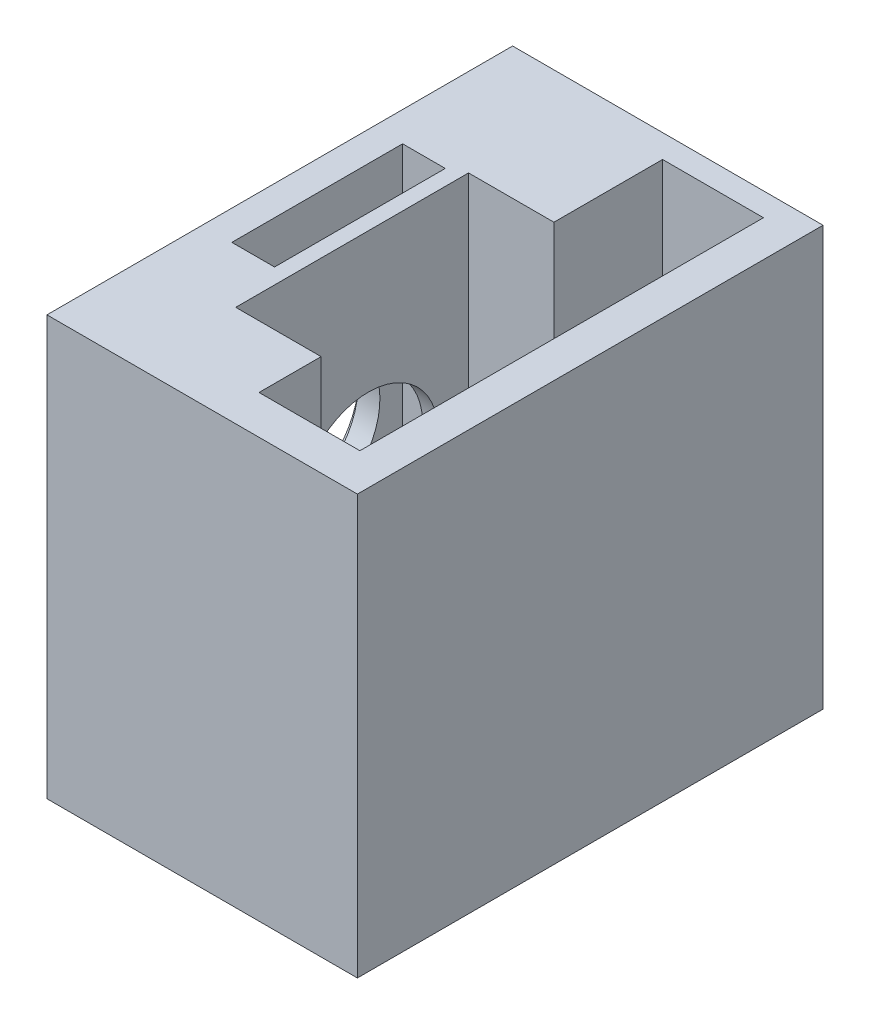
ISO-10303-21;
HEADER;
FILE_DESCRIPTION(('STEP AP214'),'2;1');
FILE_NAME('part.step','',(''),(''),'','','');
FILE_SCHEMA(('AUTOMOTIVE_DESIGN { 1 0 10303 214 1 1 1 1 }'));
ENDSEC;
DATA;
#1=APPLICATION_CONTEXT('core data for automotive mechanical design processes');
#2=APPLICATION_PROTOCOL_DEFINITION('international standard','automotive_design',2000,#1);
#3=PRODUCT_CONTEXT('',#1,'mechanical');
#4=PRODUCT('Part','Part','',(#3));
#5=PRODUCT_RELATED_PRODUCT_CATEGORY('part','',(#4));
#6=PRODUCT_DEFINITION_FORMATION('','',#4);
#7=PRODUCT_DEFINITION_CONTEXT('part definition',#1,'design');
#8=PRODUCT_DEFINITION('design','',#6,#7);
#9=PRODUCT_DEFINITION_SHAPE('','',#8);
#10=(LENGTH_UNIT() NAMED_UNIT(*) SI_UNIT(.MILLI.,.METRE.));
#11=(NAMED_UNIT(*) PLANE_ANGLE_UNIT() SI_UNIT($,.RADIAN.));
#12=(NAMED_UNIT(*) SI_UNIT($,.STERADIAN.) SOLID_ANGLE_UNIT());
#13=UNCERTAINTY_MEASURE_WITH_UNIT(LENGTH_MEASURE(1.E-05),#10,'distance_accuracy_value','');
#14=(GEOMETRIC_REPRESENTATION_CONTEXT(3) GLOBAL_UNCERTAINTY_ASSIGNED_CONTEXT((#13)) GLOBAL_UNIT_ASSIGNED_CONTEXT((#10,
#11,#12)) REPRESENTATION_CONTEXT('',''));
#15=CARTESIAN_POINT('',(0.,0.,0.));
#16=DIRECTION('',(0.,0.,1.));
#17=DIRECTION('',(1.,0.,0.));
#18=AXIS2_PLACEMENT_3D('',#15,#16,#17);
#19=CARTESIAN_POINT('',(0.,9.5,0.));
#20=DIRECTION('',(0.,1.,0.));
#21=DIRECTION('',(0.,0.,1.));
#22=AXIS2_PLACEMENT_3D('',#19,#20,#21);
#23=PLANE('',#22);
#24=DIRECTION('',(-1.,0.,0.));
#25=VECTOR('',#24,1.);
#26=CARTESIAN_POINT('',(6.5,9.5,-17.1015528128088));
#27=LINE('',#26,#25);
#28=CARTESIAN_POINT('',(4.66196126146727,9.5,-17.1015528128088));
#29=VERTEX_POINT('',#28);
#30=CARTESIAN_POINT('',(1.91196126146727,9.5,-17.1015528128088));
#31=VERTEX_POINT('',#30);
#32=EDGE_CURVE('E11',#29,#31,#27,.T.);
#33=ORIENTED_EDGE('',*,*,#32,.F.);
#34=DIRECTION('',(0.,0.,-1.));
#35=VECTOR('',#34,1.);
#36=CARTESIAN_POINT('',(4.66196126146727,9.5,-21.));
#37=LINE('',#36,#35);
#38=CARTESIAN_POINT('',(4.66196126146727,9.5,-21.));
#39=VERTEX_POINT('',#38);
#40=EDGE_CURVE('E173',#29,#39,#37,.T.);
#41=ORIENTED_EDGE('',*,*,#40,.T.);
#42=DIRECTION('',(-1.,0.,0.));
#43=VECTOR('',#42,1.);
#44=CARTESIAN_POINT('',(1.91196126146727,9.5,-21.));
#45=LINE('',#44,#43);
#46=CARTESIAN_POINT('',(1.91196126146727,9.5,-21.));
#47=VERTEX_POINT('',#46);
#48=EDGE_CURVE('E179',#39,#47,#45,.T.);
#49=ORIENTED_EDGE('',*,*,#48,.T.);
#50=DIRECTION('',(0.,0.,1.));
#51=VECTOR('',#50,1.);
#52=CARTESIAN_POINT('',(1.91196126146727,9.5,-21.));
#53=LINE('',#52,#51);
#54=EDGE_CURVE('E588',#47,#31,#53,.T.);
#55=ORIENTED_EDGE('',*,*,#54,.T.);
#56=EDGE_LOOP('',(#33,#41,#49,#55));
#57=FACE_BOUND('',#56,.T.);
#58=ADVANCED_FACE('F35',(#57),#23,.T.);
#59=CARTESIAN_POINT('',(20.,27.,0.));
#60=DIRECTION('',(0.,-1.,0.));
#61=DIRECTION('',(0.,0.,-1.));
#62=AXIS2_PLACEMENT_3D('',#59,#60,#61);
#63=PLANE('',#62);
#64=DIRECTION('',(1.,0.,0.));
#65=VECTOR('',#64,1.);
#66=CARTESIAN_POINT('',(1.91196126146727,27.,-9.99999999999999));
#67=LINE('',#66,#65);
#68=CARTESIAN_POINT('',(1.91196126146728,27.,-9.99999999999999));
#69=VERTEX_POINT('',#68);
#70=CARTESIAN_POINT('',(4.66196126146727,27.,-9.99999999999999));
#71=VERTEX_POINT('',#70);
#72=EDGE_CURVE('E188',#69,#71,#67,.T.);
#73=ORIENTED_EDGE('',*,*,#72,.F.);
#74=DIRECTION('',(0.,0.,1.));
#75=VECTOR('',#74,1.);
#76=CARTESIAN_POINT('',(1.91196126146727,27.,-21.));
#77=LINE('',#76,#75);
#78=CARTESIAN_POINT('',(1.91196126146727,27.,-21.));
#79=VERTEX_POINT('',#78);
#80=EDGE_CURVE('E57',#79,#69,#77,.T.);
#81=ORIENTED_EDGE('',*,*,#80,.F.);
#82=DIRECTION('',(-1.,0.,0.));
#83=VECTOR('',#82,1.);
#84=CARTESIAN_POINT('',(1.91196126146727,27.,-21.));
#85=LINE('',#84,#83);
#86=CARTESIAN_POINT('',(4.66196126146727,27.,-21.));
#87=VERTEX_POINT('',#86);
#88=EDGE_CURVE('E195',#87,#79,#85,.T.);
#89=ORIENTED_EDGE('',*,*,#88,.F.);
#90=DIRECTION('',(0.,0.,-1.));
#91=VECTOR('',#90,1.);
#92=CARTESIAN_POINT('',(4.66196126146727,27.,-21.));
#93=LINE('',#92,#91);
#94=EDGE_CURVE('E192',#71,#87,#93,.T.);
#95=ORIENTED_EDGE('',*,*,#94,.F.);
#96=EDGE_LOOP('',(#73,#81,#89,#95));
#97=FACE_BOUND('',#96,.T.);
#98=DIRECTION('',(0.,0.,1.));
#99=VECTOR('',#98,1.);
#100=CARTESIAN_POINT('',(0.,27.,0.));
#101=LINE('',#100,#99);
#102=CARTESIAN_POINT('',(0.,27.,-30.));
#103=VERTEX_POINT('',#102);
#104=CARTESIAN_POINT('',(0.,27.,0.));
#105=VERTEX_POINT('',#104);
#106=EDGE_CURVE('E279',#103,#105,#101,.T.);
#107=ORIENTED_EDGE('',*,*,#106,.T.);
#108=DIRECTION('',(-1.,0.,0.));
#109=VECTOR('',#108,1.);
#110=CARTESIAN_POINT('',(20.,27.,0.));
#111=LINE('',#110,#109);
#112=CARTESIAN_POINT('',(20.,27.,0.));
#113=VERTEX_POINT('',#112);
#114=EDGE_CURVE('E285',#113,#105,#111,.T.);
#115=ORIENTED_EDGE('',*,*,#114,.F.);
#116=DIRECTION('',(0.,0.,1.));
#117=VECTOR('',#116,1.);
#118=CARTESIAN_POINT('',(20.,27.,0.));
#119=LINE('',#118,#117);
#120=CARTESIAN_POINT('',(20.,27.,-30.));
#121=VERTEX_POINT('',#120);
#122=EDGE_CURVE('E283',#121,#113,#119,.T.);
#123=ORIENTED_EDGE('',*,*,#122,.F.);
#124=DIRECTION('',(-1.,0.,0.));
#125=VECTOR('',#124,1.);
#126=CARTESIAN_POINT('',(20.,27.,-30.));
#127=LINE('',#126,#125);
#128=EDGE_CURVE('E295',#121,#103,#127,.T.);
#129=ORIENTED_EDGE('',*,*,#128,.T.);
#130=EDGE_LOOP('',(#107,#115,#123,#129));
#131=FACE_BOUND('',#130,.T.);
#132=DIRECTION('',(0.,0.,1.));
#133=VECTOR('',#132,1.);
#134=CARTESIAN_POINT('',(5.66196126146727,27.,-21.5));
#135=LINE('',#134,#133);
#136=CARTESIAN_POINT('',(5.66196126146727,27.,-21.5));
#137=VERTEX_POINT('',#136);
#138=CARTESIAN_POINT('',(5.66196126146727,27.,-6.5));
#139=VERTEX_POINT('',#138);
#140=EDGE_CURVE('E210',#137,#139,#135,.T.);
#141=ORIENTED_EDGE('',*,*,#140,.F.);
#142=DIRECTION('',(-1.,0.,0.));
#143=VECTOR('',#142,1.);
#144=CARTESIAN_POINT('',(5.66196126146727,27.,-21.5));
#145=LINE('',#144,#143);
#146=CARTESIAN_POINT('',(11.1619612614673,27.,-21.5));
#147=VERTEX_POINT('',#146);
#148=EDGE_CURVE('E217',#147,#137,#145,.T.);
#149=ORIENTED_EDGE('',*,*,#148,.F.);
#150=DIRECTION('',(0.,0.,1.));
#151=VECTOR('',#150,1.);
#152=CARTESIAN_POINT('',(11.1619612614673,26.9999999999758,-28.5));
#153=LINE('',#152,#151);
#154=CARTESIAN_POINT('',(11.1619612614673,27.,-28.5));
#155=VERTEX_POINT('',#154);
#156=EDGE_CURVE('E244',#155,#147,#153,.T.);
#157=ORIENTED_EDGE('',*,*,#156,.F.);
#158=DIRECTION('',(1.,0.,0.));
#159=VECTOR('',#158,1.);
#160=CARTESIAN_POINT('',(11.1619612614673,26.9999999999758,-28.5));
#161=LINE('',#160,#159);
#162=CARTESIAN_POINT('',(17.6619612614673,26.9999999999758,-28.5));
#163=VERTEX_POINT('',#162);
#164=EDGE_CURVE('E233',#155,#163,#161,.T.);
#165=ORIENTED_EDGE('',*,*,#164,.T.);
#166=DIRECTION('',(0.,0.,1.));
#167=VECTOR('',#166,1.);
#168=CARTESIAN_POINT('',(17.6619612614673,26.9999999999758,-28.5));
#169=LINE('',#168,#167);
#170=CARTESIAN_POINT('',(17.6619612614673,26.9999999999758,-2.5));
#171=VERTEX_POINT('',#170);
#172=EDGE_CURVE('E255',#163,#171,#169,.T.);
#173=ORIENTED_EDGE('',*,*,#172,.T.);
#174=DIRECTION('',(1.,0.,0.));
#175=VECTOR('',#174,1.);
#176=CARTESIAN_POINT('',(11.1619612614673,26.9999999999758,-2.5));
#177=LINE('',#176,#175);
#178=CARTESIAN_POINT('',(11.1619612614673,26.9999999999758,-2.5));
#179=VERTEX_POINT('',#178);
#180=EDGE_CURVE('E258',#179,#171,#177,.T.);
#181=ORIENTED_EDGE('',*,*,#180,.F.);
#182=CARTESIAN_POINT('',(11.1619612614673,27.,-6.5));
#183=VERTEX_POINT('',#182);
#184=EDGE_CURVE('E261',#183,#179,#153,.T.);
#185=ORIENTED_EDGE('',*,*,#184,.F.);
#186=DIRECTION('',(1.,0.,0.));
#187=VECTOR('',#186,1.);
#188=CARTESIAN_POINT('',(5.66196126146727,27.,-6.5));
#189=LINE('',#188,#187);
#190=EDGE_CURVE('E227',#139,#183,#189,.T.);
#191=ORIENTED_EDGE('',*,*,#190,.F.);
#192=EDGE_LOOP('',(#141,#149,#157,#165,#173,#181,#185,#191));
#193=FACE_BOUND('',#192,.T.);
#194=ADVANCED_FACE('F320',(#97,#131,#193),#63,.F.);
#195=CARTESIAN_POINT('',(20.,0.,0.));
#196=DIRECTION('',(0.,0.,-1.));
#197=DIRECTION('',(0.,1.,0.));
#198=AXIS2_PLACEMENT_3D('',#195,#196,#197);
#199=PLANE('',#198);
#200=DIRECTION('',(0.,-1.,0.));
#201=VECTOR('',#200,1.);
#202=CARTESIAN_POINT('',(0.,0.,0.));
#203=LINE('',#202,#201);
#204=CARTESIAN_POINT('',(0.,0.,0.));
#205=VERTEX_POINT('',#204);
#206=EDGE_CURVE('E274',#105,#205,#203,.T.);
#207=ORIENTED_EDGE('',*,*,#206,.T.);
#208=DIRECTION('',(-1.,0.,0.));
#209=VECTOR('',#208,1.);
#210=CARTESIAN_POINT('',(20.,0.,0.));
#211=LINE('',#210,#209);
#212=CARTESIAN_POINT('',(20.,0.,0.));
#213=VERTEX_POINT('',#212);
#214=EDGE_CURVE('E165',#213,#205,#211,.T.);
#215=ORIENTED_EDGE('',*,*,#214,.F.);
#216=DIRECTION('',(0.,-1.,0.));
#217=VECTOR('',#216,1.);
#218=CARTESIAN_POINT('',(20.,0.,0.));
#219=LINE('',#218,#217);
#220=EDGE_CURVE('E275',#113,#213,#219,.T.);
#221=ORIENTED_EDGE('',*,*,#220,.F.);
#222=ORIENTED_EDGE('',*,*,#114,.T.);
#223=EDGE_LOOP('',(#207,#215,#221,#222));
#224=FACE_BOUND('',#223,.T.);
#225=ADVANCED_FACE('F37',(#224),#199,.F.);
#226=CARTESIAN_POINT('',(20.,0.,0.));
#227=DIRECTION('',(0.,1.,0.));
#228=DIRECTION('',(0.,0.,1.));
#229=AXIS2_PLACEMENT_3D('',#226,#227,#228);
#230=PLANE('',#229);
#231=DIRECTION('',(0.,0.,-1.));
#232=VECTOR('',#231,1.);
#233=CARTESIAN_POINT('',(0.,0.,0.));
#234=LINE('',#233,#232);
#235=CARTESIAN_POINT('',(0.,0.,-30.));
#236=VERTEX_POINT('',#235);
#237=EDGE_CURVE('E288',#205,#236,#234,.T.);
#238=ORIENTED_EDGE('',*,*,#237,.T.);
#239=DIRECTION('',(-1.,0.,0.));
#240=VECTOR('',#239,1.);
#241=CARTESIAN_POINT('',(20.,0.,-30.));
#242=LINE('',#241,#240);
#243=CARTESIAN_POINT('',(20.,0.,-30.));
#244=VERTEX_POINT('',#243);
#245=EDGE_CURVE('E298',#244,#236,#242,.T.);
#246=ORIENTED_EDGE('',*,*,#245,.F.);
#247=DIRECTION('',(0.,0.,-1.));
#248=VECTOR('',#247,1.);
#249=CARTESIAN_POINT('',(20.,0.,0.));
#250=LINE('',#249,#248);
#251=EDGE_CURVE('E278',#213,#244,#250,.T.);
#252=ORIENTED_EDGE('',*,*,#251,.F.);
#253=ORIENTED_EDGE('',*,*,#214,.T.);
#254=EDGE_LOOP('',(#238,#246,#252,#253));
#255=FACE_BOUND('',#254,.T.);
#256=ADVANCED_FACE('F304',(#255),#230,.F.);
#257=CARTESIAN_POINT('',(20.,0.,-30.));
#258=DIRECTION('',(0.,0.,1.));
#259=DIRECTION('',(1.,0.,0.));
#260=AXIS2_PLACEMENT_3D('',#257,#258,#259);
#261=PLANE('',#260);
#262=DIRECTION('',(0.,1.,0.));
#263=VECTOR('',#262,1.);
#264=CARTESIAN_POINT('',(0.,0.,-30.));
#265=LINE('',#264,#263);
#266=EDGE_CURVE('E290',#236,#103,#265,.T.);
#267=ORIENTED_EDGE('',*,*,#266,.T.);
#268=ORIENTED_EDGE('',*,*,#128,.F.);
#269=DIRECTION('',(0.,1.,0.));
#270=VECTOR('',#269,1.);
#271=CARTESIAN_POINT('',(20.,0.,-30.));
#272=LINE('',#271,#270);
#273=EDGE_CURVE('E281',#244,#121,#272,.T.);
#274=ORIENTED_EDGE('',*,*,#273,.F.);
#275=ORIENTED_EDGE('',*,*,#245,.T.);
#276=EDGE_LOOP('',(#267,#268,#274,#275));
#277=FACE_BOUND('',#276,.T.);
#278=ADVANCED_FACE('F316',(#277),#261,.F.);
#279=CARTESIAN_POINT('',(20.,0.,0.));
#280=DIRECTION('',(-1.,0.,0.));
#281=DIRECTION('',(0.,0.,1.));
#282=AXIS2_PLACEMENT_3D('',#279,#280,#281);
#283=PLANE('',#282);
#284=ORIENTED_EDGE('',*,*,#220,.T.);
#285=ORIENTED_EDGE('',*,*,#251,.T.);
#286=ORIENTED_EDGE('',*,*,#273,.T.);
#287=ORIENTED_EDGE('',*,*,#122,.T.);
#288=EDGE_LOOP('',(#284,#285,#286,#287));
#289=FACE_BOUND('',#288,.T.);
#290=ADVANCED_FACE('F323',(#289),#283,.F.);
#291=CARTESIAN_POINT('',(0.,0.,0.));
#292=DIRECTION('',(-1.,0.,0.));
#293=DIRECTION('',(0.,0.,1.));
#294=AXIS2_PLACEMENT_3D('',#291,#292,#293);
#295=PLANE('',#294);
#296=CARTESIAN_POINT('',(0.,13.5,-15.1));
#297=DIRECTION('',(-1.,0.,0.));
#298=DIRECTION('',(0.,0.,1.));
#299=AXIS2_PLACEMENT_3D('',#296,#297,#298);
#300=CIRCLE('',#299,5.);
#301=CARTESIAN_POINT('',(0.,13.5,-10.1));
#302=VERTEX_POINT('',#301);
#303=EDGE_CURVE('E201',#302,#302,#300,.T.);
#304=ORIENTED_EDGE('',*,*,#303,.F.);
#305=EDGE_LOOP('',(#304));
#306=FACE_BOUND('',#305,.T.);
#307=ORIENTED_EDGE('',*,*,#206,.F.);
#308=ORIENTED_EDGE('',*,*,#106,.F.);
#309=ORIENTED_EDGE('',*,*,#266,.F.);
#310=ORIENTED_EDGE('',*,*,#237,.F.);
#311=EDGE_LOOP('',(#307,#308,#309,#310));
#312=FACE_BOUND('',#311,.T.);
#313=ADVANCED_FACE('F312',(#306,#312),#295,.T.);
#314=CARTESIAN_POINT('',(11.1619612614673,0.999999999975808,-28.5));
#315=DIRECTION('',(0.,0.,1.));
#316=DIRECTION('',(1.,0.,0.));
#317=AXIS2_PLACEMENT_3D('',#314,#315,#316);
#318=PLANE('',#317);
#319=ORIENTED_EDGE('',*,*,#164,.F.);
#320=DIRECTION('',(0.,1.,0.));
#321=VECTOR('',#320,1.);
#322=CARTESIAN_POINT('',(11.1619612614673,0.999999999975808,-28.5));
#323=LINE('',#322,#321);
#324=CARTESIAN_POINT('',(11.1619612614673,0.999999999975808,-28.5));
#325=VERTEX_POINT('',#324);
#326=EDGE_CURVE('E252',#325,#155,#323,.T.);
#327=ORIENTED_EDGE('',*,*,#326,.F.);
#328=DIRECTION('',(1.,0.,0.));
#329=VECTOR('',#328,1.);
#330=CARTESIAN_POINT('',(11.1619612614673,0.999999999975808,-28.5));
#331=LINE('',#330,#329);
#332=CARTESIAN_POINT('',(17.6619612614673,0.999999999975808,-28.5));
#333=VERTEX_POINT('',#332);
#334=EDGE_CURVE('E240',#325,#333,#331,.T.);
#335=ORIENTED_EDGE('',*,*,#334,.T.);
#336=DIRECTION('',(0.,1.,0.));
#337=VECTOR('',#336,1.);
#338=CARTESIAN_POINT('',(17.6619612614673,0.999999999975808,-28.5));
#339=LINE('',#338,#337);
#340=EDGE_CURVE('E271',#333,#163,#339,.T.);
#341=ORIENTED_EDGE('',*,*,#340,.T.);
#342=EDGE_LOOP('',(#319,#327,#335,#341));
#343=FACE_BOUND('',#342,.T.);
#344=ADVANCED_FACE('F330',(#343),#318,.T.);
#345=CARTESIAN_POINT('',(17.6619612614673,0.999999999975808,-28.5));
#346=DIRECTION('',(-1.,0.,0.));
#347=DIRECTION('',(0.,0.,1.));
#348=AXIS2_PLACEMENT_3D('',#345,#346,#347);
#349=PLANE('',#348);
#350=ORIENTED_EDGE('',*,*,#172,.F.);
#351=ORIENTED_EDGE('',*,*,#340,.F.);
#352=DIRECTION('',(0.,0.,1.));
#353=VECTOR('',#352,1.);
#354=CARTESIAN_POINT('',(17.6619612614673,0.999999999975808,-28.5));
#355=LINE('',#354,#353);
#356=CARTESIAN_POINT('',(17.6619612614673,0.999999999975808,-2.5));
#357=VERTEX_POINT('',#356);
#358=EDGE_CURVE('E243',#333,#357,#355,.T.);
#359=ORIENTED_EDGE('',*,*,#358,.T.);
#360=DIRECTION('',(0.,1.,0.));
#361=VECTOR('',#360,1.);
#362=CARTESIAN_POINT('',(17.6619612614673,0.999999999975808,-2.5));
#363=LINE('',#362,#361);
#364=EDGE_CURVE('E269',#357,#171,#363,.T.);
#365=ORIENTED_EDGE('',*,*,#364,.T.);
#366=EDGE_LOOP('',(#350,#351,#359,#365));
#367=FACE_BOUND('',#366,.T.);
#368=ADVANCED_FACE('F398',(#367),#349,.T.);
#369=CARTESIAN_POINT('',(11.1619612614673,0.999999999975808,-2.5));
#370=DIRECTION('',(0.,0.,1.));
#371=DIRECTION('',(1.,0.,0.));
#372=AXIS2_PLACEMENT_3D('',#369,#370,#371);
#373=PLANE('',#372);
#374=ORIENTED_EDGE('',*,*,#180,.T.);
#375=ORIENTED_EDGE('',*,*,#364,.F.);
#376=DIRECTION('',(1.,0.,0.));
#377=VECTOR('',#376,1.);
#378=CARTESIAN_POINT('',(11.1619612614673,0.999999999975808,-2.5));
#379=LINE('',#378,#377);
#380=CARTESIAN_POINT('',(11.1619612614673,0.999999999975808,-2.5));
#381=VERTEX_POINT('',#380);
#382=EDGE_CURVE('E246',#381,#357,#379,.T.);
#383=ORIENTED_EDGE('',*,*,#382,.F.);
#384=DIRECTION('',(0.,1.,0.));
#385=VECTOR('',#384,1.);
#386=CARTESIAN_POINT('',(11.1619612614673,0.999999999975808,-2.5));
#387=LINE('',#386,#385);
#388=EDGE_CURVE('E266',#381,#179,#387,.T.);
#389=ORIENTED_EDGE('',*,*,#388,.T.);
#390=EDGE_LOOP('',(#374,#375,#383,#389));
#391=FACE_BOUND('',#390,.T.);
#392=ADVANCED_FACE('F394',(#391),#373,.F.);
#393=CARTESIAN_POINT('',(11.1619612614673,0.999999999975808,-28.5));
#394=DIRECTION('',(-1.,0.,0.));
#395=DIRECTION('',(0.,0.,1.));
#396=AXIS2_PLACEMENT_3D('',#393,#394,#395);
#397=PLANE('',#396);
#398=ORIENTED_EDGE('',*,*,#156,.T.);
#399=DIRECTION('',(0.,1.,0.));
#400=VECTOR('',#399,1.);
#401=CARTESIAN_POINT('',(11.1619612614673,6.,-21.5));
#402=LINE('',#401,#400);
#403=CARTESIAN_POINT('',(11.1619612614673,6.,-21.5));
#404=VERTEX_POINT('',#403);
#405=EDGE_CURVE('E234',#404,#147,#402,.T.);
#406=ORIENTED_EDGE('',*,*,#405,.F.);
#407=DIRECTION('',(0.,0.,-1.));
#408=VECTOR('',#407,1.);
#409=CARTESIAN_POINT('',(11.1619612614673,6.,-21.5));
#410=LINE('',#409,#408);
#411=CARTESIAN_POINT('',(11.1619612614673,6.,-6.5));
#412=VERTEX_POINT('',#411);
#413=EDGE_CURVE('E219',#412,#404,#410,.T.);
#414=ORIENTED_EDGE('',*,*,#413,.F.);
#415=DIRECTION('',(0.,1.,0.));
#416=VECTOR('',#415,1.);
#417=CARTESIAN_POINT('',(11.1619612614673,6.,-6.5));
#418=LINE('',#417,#416);
#419=EDGE_CURVE('E236',#412,#183,#418,.T.);
#420=ORIENTED_EDGE('',*,*,#419,.T.);
#421=ORIENTED_EDGE('',*,*,#184,.T.);
#422=ORIENTED_EDGE('',*,*,#388,.F.);
#423=DIRECTION('',(0.,0.,1.));
#424=VECTOR('',#423,1.);
#425=CARTESIAN_POINT('',(11.1619612614673,0.999999999975808,-28.5));
#426=LINE('',#425,#424);
#427=EDGE_CURVE('E249',#325,#381,#426,.T.);
#428=ORIENTED_EDGE('',*,*,#427,.F.);
#429=ORIENTED_EDGE('',*,*,#326,.T.);
#430=EDGE_LOOP('',(#398,#406,#414,#420,#421,#422,#428,#429));
#431=FACE_BOUND('',#430,.T.);
#432=ADVANCED_FACE('F390',(#431),#397,.F.);
#433=CARTESIAN_POINT('',(0.,0.999999999975808,0.));
#434=DIRECTION('',(0.,-1.,0.));
#435=DIRECTION('',(0.,0.,-1.));
#436=AXIS2_PLACEMENT_3D('',#433,#434,#435);
#437=PLANE('',#436);
#438=ORIENTED_EDGE('',*,*,#334,.F.);
#439=ORIENTED_EDGE('',*,*,#427,.T.);
#440=ORIENTED_EDGE('',*,*,#382,.T.);
#441=ORIENTED_EDGE('',*,*,#358,.F.);
#442=EDGE_LOOP('',(#438,#439,#440,#441));
#443=FACE_BOUND('',#442,.T.);
#444=ADVANCED_FACE('F386',(#443),#437,.F.);
#445=CARTESIAN_POINT('',(5.66196126146727,6.,-21.5));
#446=DIRECTION('',(-1.,0.,0.));
#447=DIRECTION('',(0.,0.,1.));
#448=AXIS2_PLACEMENT_3D('',#445,#446,#447);
#449=PLANE('',#448);
#450=CARTESIAN_POINT('',(5.66196126146727,13.5,-15.04));
#451=DIRECTION('',(-1.,0.,0.));
#452=DIRECTION('',(0.,0.,1.));
#453=AXIS2_PLACEMENT_3D('',#450,#451,#452);
#454=CIRCLE('',#453,4.5);
#455=CARTESIAN_POINT('',(5.66196126146727,13.5,-10.54));
#456=VERTEX_POINT('',#455);
#457=EDGE_CURVE('E189',#456,#456,#454,.T.);
#458=ORIENTED_EDGE('',*,*,#457,.T.);
#459=EDGE_LOOP('',(#458));
#460=FACE_BOUND('',#459,.T.);
#461=ORIENTED_EDGE('',*,*,#140,.T.);
#462=DIRECTION('',(0.,1.,0.));
#463=VECTOR('',#462,1.);
#464=CARTESIAN_POINT('',(5.66196126146727,6.,-6.5));
#465=LINE('',#464,#463);
#466=CARTESIAN_POINT('',(5.66196126146727,6.,-6.5));
#467=VERTEX_POINT('',#466);
#468=EDGE_CURVE('E224',#467,#139,#465,.T.);
#469=ORIENTED_EDGE('',*,*,#468,.F.);
#470=DIRECTION('',(0.,0.,1.));
#471=VECTOR('',#470,1.);
#472=CARTESIAN_POINT('',(5.66196126146727,6.,-21.5));
#473=LINE('',#472,#471);
#474=CARTESIAN_POINT('',(5.66196126146727,6.,-21.5));
#475=VERTEX_POINT('',#474);
#476=EDGE_CURVE('E213',#475,#467,#473,.T.);
#477=ORIENTED_EDGE('',*,*,#476,.F.);
#478=DIRECTION('',(0.,1.,0.));
#479=VECTOR('',#478,1.);
#480=CARTESIAN_POINT('',(5.66196126146727,6.,-21.5));
#481=LINE('',#480,#479);
#482=EDGE_CURVE('E231',#475,#137,#481,.T.);
#483=ORIENTED_EDGE('',*,*,#482,.T.);
#484=EDGE_LOOP('',(#461,#469,#477,#483));
#485=FACE_BOUND('',#484,.T.);
#486=ADVANCED_FACE('F379',(#460,#485),#449,.F.);
#487=CARTESIAN_POINT('',(5.66196126146727,6.,-21.5));
#488=DIRECTION('',(0.,0.,-1.));
#489=DIRECTION('',(-1.,0.,0.));
#490=AXIS2_PLACEMENT_3D('',#487,#488,#489);
#491=PLANE('',#490);
#492=ORIENTED_EDGE('',*,*,#148,.T.);
#493=ORIENTED_EDGE('',*,*,#482,.F.);
#494=DIRECTION('',(-1.,0.,0.));
#495=VECTOR('',#494,1.);
#496=CARTESIAN_POINT('',(5.66196126146727,6.,-21.5));
#497=LINE('',#496,#495);
#498=EDGE_CURVE('E221',#404,#475,#497,.T.);
#499=ORIENTED_EDGE('',*,*,#498,.F.);
#500=ORIENTED_EDGE('',*,*,#405,.T.);
#501=EDGE_LOOP('',(#492,#493,#499,#500));
#502=FACE_BOUND('',#501,.T.);
#503=ADVANCED_FACE('F376',(#502),#491,.F.);
#504=CARTESIAN_POINT('',(5.66196126146727,6.,-6.5));
#505=DIRECTION('',(0.,0.,1.));
#506=DIRECTION('',(1.,0.,0.));
#507=AXIS2_PLACEMENT_3D('',#504,#505,#506);
#508=PLANE('',#507);
#509=ORIENTED_EDGE('',*,*,#190,.T.);
#510=ORIENTED_EDGE('',*,*,#419,.F.);
#511=DIRECTION('',(1.,0.,0.));
#512=VECTOR('',#511,1.);
#513=CARTESIAN_POINT('',(5.66196126146727,6.,-6.5));
#514=LINE('',#513,#512);
#515=EDGE_CURVE('E216',#467,#412,#514,.T.);
#516=ORIENTED_EDGE('',*,*,#515,.F.);
#517=ORIENTED_EDGE('',*,*,#468,.T.);
#518=EDGE_LOOP('',(#509,#510,#516,#517));
#519=FACE_BOUND('',#518,.T.);
#520=ADVANCED_FACE('F374',(#519),#508,.F.);
#521=CARTESIAN_POINT('',(0.,6.,0.));
#522=DIRECTION('',(0.,1.,0.));
#523=DIRECTION('',(0.,0.,1.));
#524=AXIS2_PLACEMENT_3D('',#521,#522,#523);
#525=PLANE('',#524);
#526=ORIENTED_EDGE('',*,*,#476,.T.);
#527=ORIENTED_EDGE('',*,*,#515,.T.);
#528=ORIENTED_EDGE('',*,*,#413,.T.);
#529=ORIENTED_EDGE('',*,*,#498,.T.);
#530=EDGE_LOOP('',(#526,#527,#528,#529));
#531=FACE_BOUND('',#530,.T.);
#532=ADVANCED_FACE('F370',(#531),#525,.T.);
#533=CARTESIAN_POINT('',(0.5,13.5,-15.1));
#534=DIRECTION('',(-1.,0.,0.));
#535=DIRECTION('',(0.,0.,1.));
#536=AXIS2_PLACEMENT_3D('',#533,#534,#535);
#537=CYLINDRICAL_SURFACE('',#536,5.);
#538=CARTESIAN_POINT('',(0.5,13.5,-15.1));
#539=DIRECTION('',(-1.,0.,0.));
#540=DIRECTION('',(0.,0.,1.));
#541=AXIS2_PLACEMENT_3D('',#538,#539,#540);
#542=CIRCLE('',#541,5.);
#543=CARTESIAN_POINT('',(0.5,13.5,-10.1));
#544=VERTEX_POINT('',#543);
#545=EDGE_CURVE('E207',#544,#544,#542,.T.);
#546=ORIENTED_EDGE('',*,*,#545,.F.);
#547=EDGE_LOOP('',(#546));
#548=FACE_BOUND('',#547,.T.);
#549=ORIENTED_EDGE('',*,*,#303,.T.);
#550=EDGE_LOOP('',(#549));
#551=FACE_BOUND('',#550,.T.);
#552=ADVANCED_FACE('F366',(#548,#551),#537,.F.);
#553=CARTESIAN_POINT('',(0.5,13.5,-15.1));
#554=DIRECTION('',(-1.,0.,0.));
#555=DIRECTION('',(0.,0.,1.));
#556=AXIS2_PLACEMENT_3D('',#553,#554,#555);
#557=PLANE('',#556);
#558=CARTESIAN_POINT('',(0.5,13.5,-15.04));
#559=DIRECTION('',(-1.,0.,0.));
#560=DIRECTION('',(0.,0.,1.));
#561=AXIS2_PLACEMENT_3D('',#558,#559,#560);
#562=CIRCLE('',#561,4.5);
#563=CARTESIAN_POINT('',(0.5,13.5,-10.54));
#564=VERTEX_POINT('',#563);
#565=EDGE_CURVE('E174',#564,#564,#562,.T.);
#566=ORIENTED_EDGE('',*,*,#565,.F.);
#567=EDGE_LOOP('',(#566));
#568=FACE_BOUND('',#567,.T.);
#569=ORIENTED_EDGE('',*,*,#545,.T.);
#570=EDGE_LOOP('',(#569));
#571=FACE_BOUND('',#570,.T.);
#572=ADVANCED_FACE('F363',(#568,#571),#557,.T.);
#573=CARTESIAN_POINT('',(1.91196126146727,9.5,-21.));
#574=DIRECTION('',(-1.,0.,0.));
#575=DIRECTION('',(0.,0.,1.));
#576=AXIS2_PLACEMENT_3D('',#573,#574,#575);
#577=PLANE('',#576);
#578=CARTESIAN_POINT('',(1.91196126146727,9.5,-12.9784471871912));
#579=VERTEX_POINT('',#578);
#580=CARTESIAN_POINT('',(1.91196126146727,9.5,-9.99999999999999));
#581=VERTEX_POINT('',#580);
#582=EDGE_CURVE('E198',#579,#581,#53,.T.);
#583=ORIENTED_EDGE('',*,*,#582,.F.);
#584=CARTESIAN_POINT('',(1.91196126146727,13.5,-15.04));
#585=DIRECTION('',(-1.,0.,0.));
#586=DIRECTION('',(0.,0.,1.));
#587=AXIS2_PLACEMENT_3D('',#584,#585,#586);
#588=CIRCLE('',#587,4.5);
#589=EDGE_CURVE('E49',#579,#31,#588,.T.);
#590=ORIENTED_EDGE('',*,*,#589,.T.);
#591=ORIENTED_EDGE('',*,*,#54,.F.);
#592=DIRECTION('',(0.,1.,0.));
#593=VECTOR('',#592,1.);
#594=CARTESIAN_POINT('',(1.91196126146727,9.5,-21.));
#595=LINE('',#594,#593);
#596=EDGE_CURVE('E199',#47,#79,#595,.T.);
#597=ORIENTED_EDGE('',*,*,#596,.T.);
#598=ORIENTED_EDGE('',*,*,#80,.T.);
#599=DIRECTION('',(0.,1.,0.));
#600=VECTOR('',#599,1.);
#601=CARTESIAN_POINT('',(1.91196126146727,9.5,-9.99999999999999));
#602=LINE('',#601,#600);
#603=EDGE_CURVE('E182',#581,#69,#602,.T.);
#604=ORIENTED_EDGE('',*,*,#603,.F.);
#605=EDGE_LOOP('',(#583,#590,#591,#597,#598,#604));
#606=FACE_BOUND('',#605,.T.);
#607=ADVANCED_FACE('F360',(#606),#577,.F.);
#608=CARTESIAN_POINT('',(1.91196126146727,9.5,-21.));
#609=DIRECTION('',(0.,0.,-1.));
#610=DIRECTION('',(-1.,0.,0.));
#611=AXIS2_PLACEMENT_3D('',#608,#609,#610);
#612=PLANE('',#611);
#613=ORIENTED_EDGE('',*,*,#88,.T.);
#614=ORIENTED_EDGE('',*,*,#596,.F.);
#615=ORIENTED_EDGE('',*,*,#48,.F.);
#616=DIRECTION('',(0.,1.,0.));
#617=VECTOR('',#616,1.);
#618=CARTESIAN_POINT('',(4.66196126146727,9.5,-21.));
#619=LINE('',#618,#617);
#620=EDGE_CURVE('E202',#39,#87,#619,.T.);
#621=ORIENTED_EDGE('',*,*,#620,.T.);
#622=EDGE_LOOP('',(#613,#614,#615,#621));
#623=FACE_BOUND('',#622,.T.);
#624=ADVANCED_FACE('F357',(#623),#612,.F.);
#625=CARTESIAN_POINT('',(4.66196126146727,9.5,-21.));
#626=DIRECTION('',(1.,0.,0.));
#627=DIRECTION('',(0.,0.,-1.));
#628=AXIS2_PLACEMENT_3D('',#625,#626,#627);
#629=PLANE('',#628);
#630=ORIENTED_EDGE('',*,*,#40,.F.);
#631=CARTESIAN_POINT('',(4.66196126146727,13.5,-15.04));
#632=DIRECTION('',(1.,0.,0.));
#633=DIRECTION('',(0.,0.,-1.));
#634=AXIS2_PLACEMENT_3D('',#631,#632,#633);
#635=CIRCLE('',#634,4.5);
#636=CARTESIAN_POINT('',(4.66196126146727,9.5,-12.9784471871912));
#637=VERTEX_POINT('',#636);
#638=EDGE_CURVE('E160',#29,#637,#635,.T.);
#639=ORIENTED_EDGE('',*,*,#638,.T.);
#640=CARTESIAN_POINT('',(4.66196126146727,9.5,-9.99999999999999));
#641=VERTEX_POINT('',#640);
#642=EDGE_CURVE('E170',#641,#637,#37,.T.);
#643=ORIENTED_EDGE('',*,*,#642,.F.);
#644=DIRECTION('',(0.,1.,0.));
#645=VECTOR('',#644,1.);
#646=CARTESIAN_POINT('',(4.66196126146727,9.5,-9.99999999999999));
#647=LINE('',#646,#645);
#648=EDGE_CURVE('E204',#641,#71,#647,.T.);
#649=ORIENTED_EDGE('',*,*,#648,.T.);
#650=ORIENTED_EDGE('',*,*,#94,.T.);
#651=ORIENTED_EDGE('',*,*,#620,.F.);
#652=EDGE_LOOP('',(#630,#639,#643,#649,#650,#651));
#653=FACE_BOUND('',#652,.T.);
#654=ADVANCED_FACE('F169',(#653),#629,.F.);
#655=CARTESIAN_POINT('',(1.91196126146727,9.5,-9.99999999999999));
#656=DIRECTION('',(0.,0.,1.));
#657=DIRECTION('',(1.,0.,0.));
#658=AXIS2_PLACEMENT_3D('',#655,#656,#657);
#659=PLANE('',#658);
#660=ORIENTED_EDGE('',*,*,#72,.T.);
#661=ORIENTED_EDGE('',*,*,#648,.F.);
#662=DIRECTION('',(1.,0.,0.));
#663=VECTOR('',#662,1.);
#664=CARTESIAN_POINT('',(1.91196126146727,9.5,-9.99999999999999));
#665=LINE('',#664,#663);
#666=EDGE_CURVE('E178',#581,#641,#665,.T.);
#667=ORIENTED_EDGE('',*,*,#666,.F.);
#668=ORIENTED_EDGE('',*,*,#603,.T.);
#669=EDGE_LOOP('',(#660,#661,#667,#668));
#670=FACE_BOUND('',#669,.T.);
#671=ADVANCED_FACE('F346',(#670),#659,.F.);
#672=DIRECTION('',(-1.,0.,0.));
#673=VECTOR('',#672,1.);
#674=CARTESIAN_POINT('',(6.5,9.5,-12.9784471871912));
#675=LINE('',#674,#673);
#676=EDGE_CURVE('E43',#579,#637,#675,.F.);
#677=ORIENTED_EDGE('',*,*,#676,.F.);
#678=ORIENTED_EDGE('',*,*,#582,.T.);
#679=ORIENTED_EDGE('',*,*,#666,.T.);
#680=ORIENTED_EDGE('',*,*,#642,.T.);
#681=EDGE_LOOP('',(#677,#678,#679,#680));
#682=FACE_BOUND('',#681,.T.);
#683=ADVANCED_FACE('F176',(#682),#23,.T.);
#684=CARTESIAN_POINT('',(6.5,13.5,-15.04));
#685=DIRECTION('',(-1.,0.,0.));
#686=DIRECTION('',(0.,0.,1.));
#687=AXIS2_PLACEMENT_3D('',#684,#685,#686);
#688=CYLINDRICAL_SURFACE('',#687,4.5);
#689=ORIENTED_EDGE('',*,*,#565,.T.);
#690=EDGE_LOOP('',(#689));
#691=FACE_BOUND('',#690,.T.);
#692=ORIENTED_EDGE('',*,*,#32,.T.);
#693=ORIENTED_EDGE('',*,*,#589,.F.);
#694=ORIENTED_EDGE('',*,*,#676,.T.);
#695=ORIENTED_EDGE('',*,*,#638,.F.);
#696=EDGE_LOOP('',(#692,#693,#694,#695));
#697=FACE_BOUND('',#696,.T.);
#698=ORIENTED_EDGE('',*,*,#457,.F.);
#699=EDGE_LOOP('',(#698));
#700=FACE_BOUND('',#699,.T.);
#701=ADVANCED_FACE('F158',(#691,#697,#700),#688,.F.);
#702=CLOSED_SHELL('',(#58,#194,#225,#256,#278,#290,#313,#344,#368,#392,#432,#444,#486,#503,#520,
#532,#552,#572,#607,#624,#654,#671,#683,#701));
#703=MANIFOLD_SOLID_BREP('B2',#702);
#704=ADVANCED_BREP_SHAPE_REPRESENTATION('',(#18,#703),#14);
#705=SHAPE_DEFINITION_REPRESENTATION(#9,#704);
ENDSEC;
END-ISO-10303-21;
